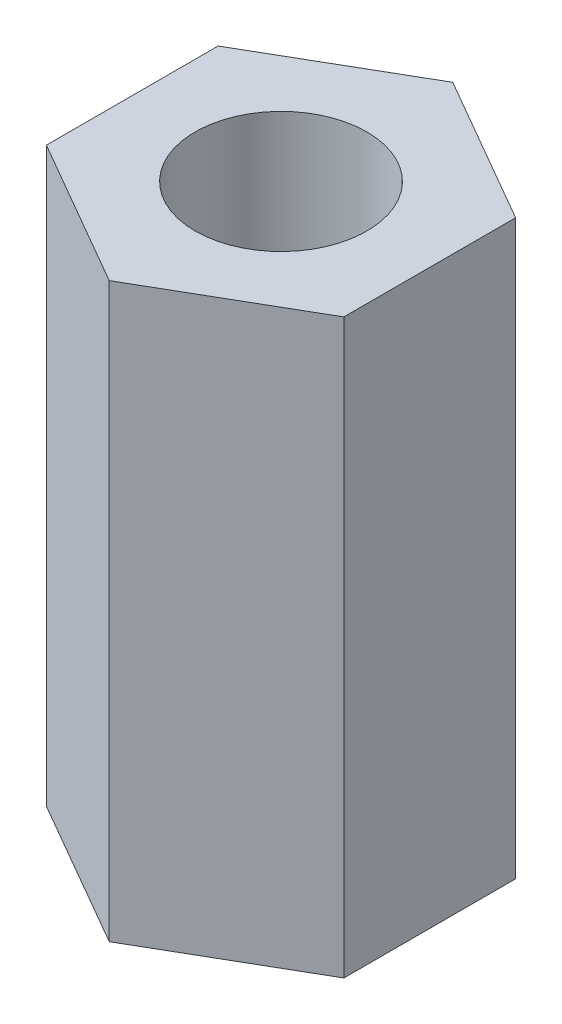
ISO-10303-21;
HEADER;
FILE_DESCRIPTION(('STEP AP214'),'2;1');
FILE_NAME('part.step','',(''),(''),'','','');
FILE_SCHEMA(('AUTOMOTIVE_DESIGN { 1 0 10303 214 1 1 1 1 }'));
ENDSEC;
DATA;
#1=APPLICATION_CONTEXT('core data for automotive mechanical design processes');
#2=APPLICATION_PROTOCOL_DEFINITION('international standard','automotive_design',2000,#1);
#3=PRODUCT_CONTEXT('',#1,'mechanical');
#4=PRODUCT('Part','Part','',(#3));
#5=PRODUCT_RELATED_PRODUCT_CATEGORY('part','',(#4));
#6=PRODUCT_DEFINITION_FORMATION('','',#4);
#7=PRODUCT_DEFINITION_CONTEXT('part definition',#1,'design');
#8=PRODUCT_DEFINITION('design','',#6,#7);
#9=PRODUCT_DEFINITION_SHAPE('','',#8);
#10=(LENGTH_UNIT() NAMED_UNIT(*) SI_UNIT(.MILLI.,.METRE.));
#11=(NAMED_UNIT(*) PLANE_ANGLE_UNIT() SI_UNIT($,.RADIAN.));
#12=(NAMED_UNIT(*) SI_UNIT($,.STERADIAN.) SOLID_ANGLE_UNIT());
#13=UNCERTAINTY_MEASURE_WITH_UNIT(LENGTH_MEASURE(1.E-05),#10,'distance_accuracy_value','');
#14=(GEOMETRIC_REPRESENTATION_CONTEXT(3) GLOBAL_UNCERTAINTY_ASSIGNED_CONTEXT((#13)) GLOBAL_UNIT_ASSIGNED_CONTEXT((#10,
#11,#12)) REPRESENTATION_CONTEXT('',''));
#15=CARTESIAN_POINT('',(0.,0.,0.));
#16=DIRECTION('',(0.,0.,1.));
#17=DIRECTION('',(1.,0.,0.));
#18=AXIS2_PLACEMENT_3D('',#15,#16,#17);
#19=CARTESIAN_POINT('',(0.,10.,-3.));
#20=DIRECTION('',(0.,1.,0.));
#21=DIRECTION('',(0.,0.,1.));
#22=AXIS2_PLACEMENT_3D('',#19,#20,#21);
#23=PLANE('',#22);
#24=DIRECTION('',(-0.866025403784439,0.,-0.5));
#25=VECTOR('',#24,1.);
#26=CARTESIAN_POINT('',(2.59807621135332,10.,-1.5));
#27=LINE('',#26,#25);
#28=CARTESIAN_POINT('',(2.59807621135332,10.,-1.5));
#29=VERTEX_POINT('',#28);
#30=CARTESIAN_POINT('',(0.,10.,-3.));
#31=VERTEX_POINT('',#30);
#32=EDGE_CURVE('E126',#29,#31,#27,.T.);
#33=ORIENTED_EDGE('',*,*,#32,.T.);
#34=DIRECTION('',(-0.866025403784439,0.,0.5));
#35=VECTOR('',#34,1.);
#36=CARTESIAN_POINT('',(0.,10.,-3.));
#37=LINE('',#36,#35);
#38=CARTESIAN_POINT('',(-2.59807621135332,10.,-1.5));
#39=VERTEX_POINT('',#38);
#40=EDGE_CURVE('E84',#31,#39,#37,.T.);
#41=ORIENTED_EDGE('',*,*,#40,.T.);
#42=DIRECTION('',(0.,0.,1.));
#43=VECTOR('',#42,1.);
#44=CARTESIAN_POINT('',(-2.59807621135332,10.,-1.5));
#45=LINE('',#44,#43);
#46=CARTESIAN_POINT('',(-2.59807621135332,10.,1.5));
#47=VERTEX_POINT('',#46);
#48=EDGE_CURVE('E97',#39,#47,#45,.T.);
#49=ORIENTED_EDGE('',*,*,#48,.T.);
#50=DIRECTION('',(0.866025403784439,0.,0.5));
#51=VECTOR('',#50,1.);
#52=CARTESIAN_POINT('',(-2.59807621135332,10.,1.5));
#53=LINE('',#52,#51);
#54=CARTESIAN_POINT('',(0.,10.,3.));
#55=VERTEX_POINT('',#54);
#56=EDGE_CURVE('E91',#47,#55,#53,.T.);
#57=ORIENTED_EDGE('',*,*,#56,.T.);
#58=DIRECTION('',(0.866025403784439,0.,-0.5));
#59=VECTOR('',#58,1.);
#60=CARTESIAN_POINT('',(0.,10.,3.));
#61=LINE('',#60,#59);
#62=CARTESIAN_POINT('',(2.59807621135332,10.,1.5));
#63=VERTEX_POINT('',#62);
#64=EDGE_CURVE('E95',#55,#63,#61,.T.);
#65=ORIENTED_EDGE('',*,*,#64,.T.);
#66=DIRECTION('',(0.,0.,-1.));
#67=VECTOR('',#66,1.);
#68=CARTESIAN_POINT('',(2.59807621135332,10.,1.5));
#69=LINE('',#68,#67);
#70=EDGE_CURVE('E47',#63,#29,#69,.T.);
#71=ORIENTED_EDGE('',*,*,#70,.T.);
#72=EDGE_LOOP('',(#33,#41,#49,#57,#65,#71));
#73=FACE_BOUND('',#72,.T.);
#74=CARTESIAN_POINT('',(0.,10.,0.));
#75=DIRECTION('',(0.,1.,0.));
#76=DIRECTION('',(0.,0.,1.));
#77=AXIS2_PLACEMENT_3D('',#74,#75,#76);
#78=CIRCLE('',#77,1.5);
#79=CARTESIAN_POINT('',(0.,10.,1.5));
#80=VERTEX_POINT('',#79);
#81=EDGE_CURVE('E119',#80,#80,#78,.T.);
#82=ORIENTED_EDGE('',*,*,#81,.F.);
#83=EDGE_LOOP('',(#82));
#84=FACE_BOUND('',#83,.T.);
#85=ADVANCED_FACE('F30',(#73,#84),#23,.T.);
#86=CARTESIAN_POINT('',(0.,0.,-3.));
#87=DIRECTION('',(0.,1.,0.));
#88=DIRECTION('',(0.,0.,1.));
#89=AXIS2_PLACEMENT_3D('',#86,#87,#88);
#90=PLANE('',#89);
#91=DIRECTION('',(-0.866025403784439,0.,-0.5));
#92=VECTOR('',#91,1.);
#93=CARTESIAN_POINT('',(2.59807621135332,0.,-1.5));
#94=LINE('',#93,#92);
#95=CARTESIAN_POINT('',(2.59807621135332,0.,-1.5));
#96=VERTEX_POINT('',#95);
#97=CARTESIAN_POINT('',(0.,0.,-3.));
#98=VERTEX_POINT('',#97);
#99=EDGE_CURVE('E115',#96,#98,#94,.T.);
#100=ORIENTED_EDGE('',*,*,#99,.F.);
#101=DIRECTION('',(0.,0.,-1.));
#102=VECTOR('',#101,1.);
#103=CARTESIAN_POINT('',(2.59807621135332,0.,1.5));
#104=LINE('',#103,#102);
#105=CARTESIAN_POINT('',(2.59807621135332,0.,1.5));
#106=VERTEX_POINT('',#105);
#107=EDGE_CURVE('E76',#106,#96,#104,.T.);
#108=ORIENTED_EDGE('',*,*,#107,.F.);
#109=DIRECTION('',(0.866025403784439,0.,-0.5));
#110=VECTOR('',#109,1.);
#111=CARTESIAN_POINT('',(0.,0.,3.));
#112=LINE('',#111,#110);
#113=CARTESIAN_POINT('',(0.,0.,3.));
#114=VERTEX_POINT('',#113);
#115=EDGE_CURVE('E70',#114,#106,#112,.T.);
#116=ORIENTED_EDGE('',*,*,#115,.F.);
#117=DIRECTION('',(0.866025403784439,0.,0.5));
#118=VECTOR('',#117,1.);
#119=CARTESIAN_POINT('',(-2.59807621135332,0.,1.5));
#120=LINE('',#119,#118);
#121=CARTESIAN_POINT('',(-2.59807621135332,0.,1.5));
#122=VERTEX_POINT('',#121);
#123=EDGE_CURVE('E105',#122,#114,#120,.T.);
#124=ORIENTED_EDGE('',*,*,#123,.F.);
#125=DIRECTION('',(0.,0.,1.));
#126=VECTOR('',#125,1.);
#127=CARTESIAN_POINT('',(-2.59807621135332,0.,-1.5));
#128=LINE('',#127,#126);
#129=CARTESIAN_POINT('',(-2.59807621135332,0.,-1.5));
#130=VERTEX_POINT('',#129);
#131=EDGE_CURVE('E121',#130,#122,#128,.T.);
#132=ORIENTED_EDGE('',*,*,#131,.F.);
#133=DIRECTION('',(-0.866025403784439,0.,0.5));
#134=VECTOR('',#133,1.);
#135=CARTESIAN_POINT('',(0.,0.,-3.));
#136=LINE('',#135,#134);
#137=EDGE_CURVE('E118',#98,#130,#136,.T.);
#138=ORIENTED_EDGE('',*,*,#137,.F.);
#139=EDGE_LOOP('',(#100,#108,#116,#124,#132,#138));
#140=FACE_BOUND('',#139,.T.);
#141=CARTESIAN_POINT('',(0.,0.,0.));
#142=DIRECTION('',(0.,1.,0.));
#143=DIRECTION('',(0.,0.,1.));
#144=AXIS2_PLACEMENT_3D('',#141,#142,#143);
#145=CIRCLE('',#144,1.5);
#146=CARTESIAN_POINT('',(0.,0.,1.5));
#147=VERTEX_POINT('',#146);
#148=EDGE_CURVE('E219',#147,#147,#145,.T.);
#149=ORIENTED_EDGE('',*,*,#148,.T.);
#150=EDGE_LOOP('',(#149));
#151=FACE_BOUND('',#150,.T.);
#152=ADVANCED_FACE('F135',(#140,#151),#90,.F.);
#153=CARTESIAN_POINT('',(2.59807621135332,10.,-1.5));
#154=DIRECTION('',(-0.5,0.,0.866025403784439));
#155=DIRECTION('',(0.866025403784439,0.,0.5));
#156=AXIS2_PLACEMENT_3D('',#153,#154,#155);
#157=PLANE('',#156);
#158=ORIENTED_EDGE('',*,*,#99,.T.);
#159=DIRECTION('',(0.,-1.,0.));
#160=VECTOR('',#159,1.);
#161=CARTESIAN_POINT('',(0.,10.,-3.));
#162=LINE('',#161,#160);
#163=EDGE_CURVE('E11',#31,#98,#162,.T.);
#164=ORIENTED_EDGE('',*,*,#163,.F.);
#165=ORIENTED_EDGE('',*,*,#32,.F.);
#166=DIRECTION('',(0.,-1.,0.));
#167=VECTOR('',#166,1.);
#168=CARTESIAN_POINT('',(2.59807621135332,10.,-1.5));
#169=LINE('',#168,#167);
#170=EDGE_CURVE('E111',#29,#96,#169,.T.);
#171=ORIENTED_EDGE('',*,*,#170,.T.);
#172=EDGE_LOOP('',(#158,#164,#165,#171));
#173=FACE_BOUND('',#172,.T.);
#174=ADVANCED_FACE('F32',(#173),#157,.F.);
#175=CARTESIAN_POINT('',(0.,10.,-3.));
#176=DIRECTION('',(0.5,0.,0.866025403784439));
#177=DIRECTION('',(0.866025403784439,0.,-0.5));
#178=AXIS2_PLACEMENT_3D('',#175,#176,#177);
#179=PLANE('',#178);
#180=ORIENTED_EDGE('',*,*,#137,.T.);
#181=DIRECTION('',(0.,-1.,0.));
#182=VECTOR('',#181,1.);
#183=CARTESIAN_POINT('',(-2.59807621135332,10.,-1.5));
#184=LINE('',#183,#182);
#185=EDGE_CURVE('E39',#39,#130,#184,.T.);
#186=ORIENTED_EDGE('',*,*,#185,.F.);
#187=ORIENTED_EDGE('',*,*,#40,.F.);
#188=ORIENTED_EDGE('',*,*,#163,.T.);
#189=EDGE_LOOP('',(#180,#186,#187,#188));
#190=FACE_BOUND('',#189,.T.);
#191=ADVANCED_FACE('F160',(#190),#179,.F.);
#192=CARTESIAN_POINT('',(-2.59807621135332,10.,-1.5));
#193=DIRECTION('',(1.,0.,0.));
#194=DIRECTION('',(0.,0.,-1.));
#195=AXIS2_PLACEMENT_3D('',#192,#193,#194);
#196=PLANE('',#195);
#197=ORIENTED_EDGE('',*,*,#131,.T.);
#198=DIRECTION('',(0.,-1.,0.));
#199=VECTOR('',#198,1.);
#200=CARTESIAN_POINT('',(-2.59807621135332,10.,1.5));
#201=LINE('',#200,#199);
#202=EDGE_CURVE('E106',#47,#122,#201,.T.);
#203=ORIENTED_EDGE('',*,*,#202,.F.);
#204=ORIENTED_EDGE('',*,*,#48,.F.);
#205=ORIENTED_EDGE('',*,*,#185,.T.);
#206=EDGE_LOOP('',(#197,#203,#204,#205));
#207=FACE_BOUND('',#206,.T.);
#208=ADVANCED_FACE('F132',(#207),#196,.F.);
#209=CARTESIAN_POINT('',(-2.59807621135332,10.,1.5));
#210=DIRECTION('',(0.5,0.,-0.866025403784439));
#211=DIRECTION('',(-0.866025403784439,0.,-0.5));
#212=AXIS2_PLACEMENT_3D('',#209,#210,#211);
#213=PLANE('',#212);
#214=ORIENTED_EDGE('',*,*,#123,.T.);
#215=DIRECTION('',(0.,-1.,0.));
#216=VECTOR('',#215,1.);
#217=CARTESIAN_POINT('',(0.,10.,3.));
#218=LINE('',#217,#216);
#219=EDGE_CURVE('E102',#55,#114,#218,.T.);
#220=ORIENTED_EDGE('',*,*,#219,.F.);
#221=ORIENTED_EDGE('',*,*,#56,.F.);
#222=ORIENTED_EDGE('',*,*,#202,.T.);
#223=EDGE_LOOP('',(#214,#220,#221,#222));
#224=FACE_BOUND('',#223,.T.);
#225=ADVANCED_FACE('F103',(#224),#213,.F.);
#226=CARTESIAN_POINT('',(0.,10.,3.));
#227=DIRECTION('',(-0.5,0.,-0.866025403784439));
#228=DIRECTION('',(-0.866025403784439,0.,0.5));
#229=AXIS2_PLACEMENT_3D('',#226,#227,#228);
#230=PLANE('',#229);
#231=ORIENTED_EDGE('',*,*,#115,.T.);
#232=DIRECTION('',(0.,-1.,0.));
#233=VECTOR('',#232,1.);
#234=CARTESIAN_POINT('',(2.59807621135332,10.,1.5));
#235=LINE('',#234,#233);
#236=EDGE_CURVE('E107',#63,#106,#235,.T.);
#237=ORIENTED_EDGE('',*,*,#236,.F.);
#238=ORIENTED_EDGE('',*,*,#64,.F.);
#239=ORIENTED_EDGE('',*,*,#219,.T.);
#240=EDGE_LOOP('',(#231,#237,#238,#239));
#241=FACE_BOUND('',#240,.T.);
#242=ADVANCED_FACE('F109',(#241),#230,.F.);
#243=CARTESIAN_POINT('',(2.59807621135332,10.,1.5));
#244=DIRECTION('',(-1.,0.,0.));
#245=DIRECTION('',(0.,0.,1.));
#246=AXIS2_PLACEMENT_3D('',#243,#244,#245);
#247=PLANE('',#246);
#248=ORIENTED_EDGE('',*,*,#107,.T.);
#249=ORIENTED_EDGE('',*,*,#170,.F.);
#250=ORIENTED_EDGE('',*,*,#70,.F.);
#251=ORIENTED_EDGE('',*,*,#236,.T.);
#252=EDGE_LOOP('',(#248,#249,#250,#251));
#253=FACE_BOUND('',#252,.T.);
#254=ADVANCED_FACE('F140',(#253),#247,.F.);
#255=CARTESIAN_POINT('',(0.,10.,0.));
#256=DIRECTION('',(0.,-1.,0.));
#257=DIRECTION('',(0.,0.,-1.));
#258=AXIS2_PLACEMENT_3D('',#255,#256,#257);
#259=CYLINDRICAL_SURFACE('',#258,1.5);
#260=ORIENTED_EDGE('',*,*,#81,.T.);
#261=EDGE_LOOP('',(#260));
#262=FACE_BOUND('',#261,.T.);
#263=ORIENTED_EDGE('',*,*,#148,.F.);
#264=EDGE_LOOP('',(#263));
#265=FACE_BOUND('',#264,.T.);
#266=ADVANCED_FACE('F142',(#262,#265),#259,.F.);
#267=CLOSED_SHELL('',(#85,#152,#174,#191,#208,#225,#242,#254,#266));
#268=MANIFOLD_SOLID_BREP('B2',#267);
#269=ADVANCED_BREP_SHAPE_REPRESENTATION('',(#18,#268),#14);
#270=SHAPE_DEFINITION_REPRESENTATION(#9,#269);
ENDSEC;
END-ISO-10303-21;
